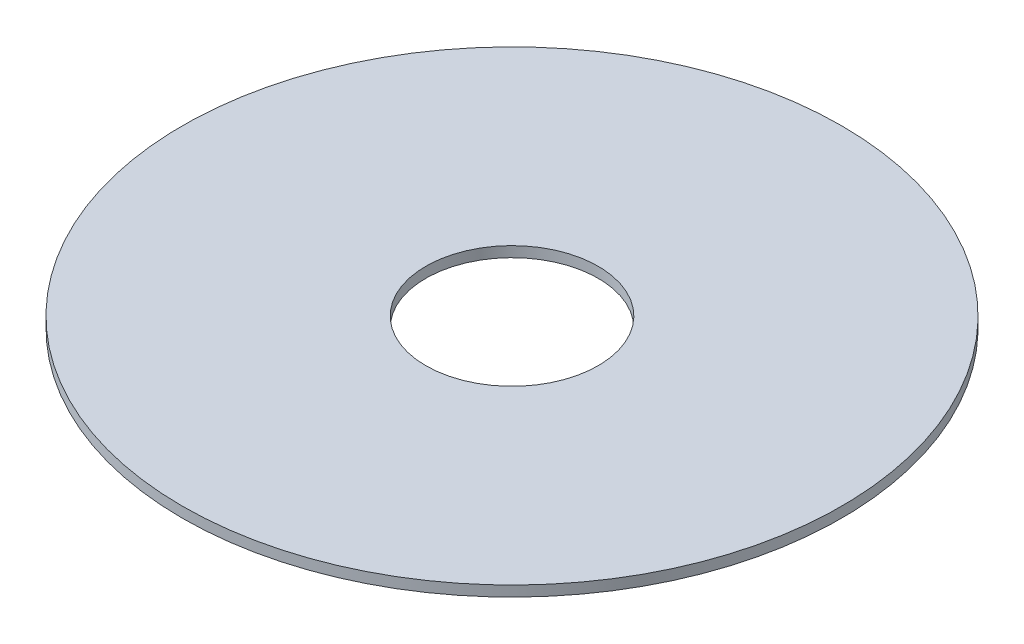
ISO-10303-21;
HEADER;
FILE_DESCRIPTION(('STEP AP214'),'2;1');
FILE_NAME('part.step','',(''),(''),'','','');
FILE_SCHEMA(('AUTOMOTIVE_DESIGN { 1 0 10303 214 1 1 1 1 }'));
ENDSEC;
DATA;
#1=APPLICATION_CONTEXT('core data for automotive mechanical design processes');
#2=APPLICATION_PROTOCOL_DEFINITION('international standard','automotive_design',2000,#1);
#3=PRODUCT_CONTEXT('',#1,'mechanical');
#4=PRODUCT('Part','Part','',(#3));
#5=PRODUCT_RELATED_PRODUCT_CATEGORY('part','',(#4));
#6=PRODUCT_DEFINITION_FORMATION('','',#4);
#7=PRODUCT_DEFINITION_CONTEXT('part definition',#1,'design');
#8=PRODUCT_DEFINITION('design','',#6,#7);
#9=PRODUCT_DEFINITION_SHAPE('','',#8);
#10=(LENGTH_UNIT() NAMED_UNIT(*) SI_UNIT(.MILLI.,.METRE.));
#11=(NAMED_UNIT(*) PLANE_ANGLE_UNIT() SI_UNIT($,.RADIAN.));
#12=(NAMED_UNIT(*) SI_UNIT($,.STERADIAN.) SOLID_ANGLE_UNIT());
#13=UNCERTAINTY_MEASURE_WITH_UNIT(LENGTH_MEASURE(1.E-05),#10,'distance_accuracy_value','');
#14=(GEOMETRIC_REPRESENTATION_CONTEXT(3) GLOBAL_UNCERTAINTY_ASSIGNED_CONTEXT((#13)) GLOBAL_UNIT_ASSIGNED_CONTEXT((#10,
#11,#12)) REPRESENTATION_CONTEXT('',''));
#15=CARTESIAN_POINT('',(0.,0.,0.));
#16=DIRECTION('',(0.,0.,1.));
#17=DIRECTION('',(1.,0.,0.));
#18=AXIS2_PLACEMENT_3D('',#15,#16,#17);
#19=CARTESIAN_POINT('',(0.,1.4875,0.));
#20=DIRECTION('',(0.,1.,0.));
#21=DIRECTION('',(0.,0.,1.));
#22=AXIS2_PLACEMENT_3D('',#19,#20,#21);
#23=PLANE('',#22);
#24=CARTESIAN_POINT('',(0.,1.4875,0.));
#25=DIRECTION('',(0.,1.,0.));
#26=DIRECTION('',(0.,0.,1.));
#27=AXIS2_PLACEMENT_3D('',#24,#25,#26);
#28=CIRCLE('',#27,40.1508);
#29=CARTESIAN_POINT('',(0.,1.4875,40.1508));
#30=VERTEX_POINT('',#29);
#31=EDGE_CURVE('E10',#30,#30,#28,.T.);
#32=ORIENTED_EDGE('',*,*,#31,.T.);
#33=EDGE_LOOP('',(#32));
#34=FACE_BOUND('',#33,.T.);
#35=CARTESIAN_POINT('',(0.,1.4875,0.));
#36=DIRECTION('',(0.,1.,0.));
#37=DIRECTION('',(0.,0.,1.));
#38=AXIS2_PLACEMENT_3D('',#35,#36,#37);
#39=CIRCLE('',#38,10.5);
#40=CARTESIAN_POINT('',(0.,1.4875,10.5));
#41=VERTEX_POINT('',#40);
#42=EDGE_CURVE('E44',#41,#41,#39,.T.);
#43=ORIENTED_EDGE('',*,*,#42,.F.);
#44=EDGE_LOOP('',(#43));
#45=FACE_BOUND('',#44,.T.);
#46=ADVANCED_FACE('F33',(#34,#45),#23,.T.);
#47=CARTESIAN_POINT('',(0.,0.2125,0.));
#48=DIRECTION('',(0.,1.,0.));
#49=DIRECTION('',(0.,0.,1.));
#50=AXIS2_PLACEMENT_3D('',#47,#48,#49);
#51=PLANE('',#50);
#52=CARTESIAN_POINT('',(0.,0.2125,0.));
#53=DIRECTION('',(0.,1.,0.));
#54=DIRECTION('',(0.,0.,1.));
#55=AXIS2_PLACEMENT_3D('',#52,#53,#54);
#56=CIRCLE('',#55,40.1508);
#57=CARTESIAN_POINT('',(0.,0.2125,40.1508));
#58=VERTEX_POINT('',#57);
#59=EDGE_CURVE('E37',#58,#58,#56,.T.);
#60=ORIENTED_EDGE('',*,*,#59,.F.);
#61=EDGE_LOOP('',(#60));
#62=FACE_BOUND('',#61,.T.);
#63=CARTESIAN_POINT('',(0.,0.2125,0.));
#64=DIRECTION('',(0.,1.,0.));
#65=DIRECTION('',(0.,0.,1.));
#66=AXIS2_PLACEMENT_3D('',#63,#64,#65);
#67=CIRCLE('',#66,10.5);
#68=CARTESIAN_POINT('',(0.,0.2125,10.5));
#69=VERTEX_POINT('',#68);
#70=EDGE_CURVE('E46',#69,#69,#67,.T.);
#71=ORIENTED_EDGE('',*,*,#70,.T.);
#72=EDGE_LOOP('',(#71));
#73=FACE_BOUND('',#72,.T.);
#74=ADVANCED_FACE('F56',(#62,#73),#51,.F.);
#75=CARTESIAN_POINT('',(0.,1.4875,0.));
#76=DIRECTION('',(0.,-1.,0.));
#77=DIRECTION('',(0.,0.,-1.));
#78=AXIS2_PLACEMENT_3D('',#75,#76,#77);
#79=CYLINDRICAL_SURFACE('',#78,40.1508);
#80=ORIENTED_EDGE('',*,*,#31,.F.);
#81=EDGE_LOOP('',(#80));
#82=FACE_BOUND('',#81,.T.);
#83=ORIENTED_EDGE('',*,*,#59,.T.);
#84=EDGE_LOOP('',(#83));
#85=FACE_BOUND('',#84,.T.);
#86=ADVANCED_FACE('F35',(#82,#85),#79,.T.);
#87=CARTESIAN_POINT('',(0.,1.4875,0.));
#88=DIRECTION('',(0.,-1.,0.));
#89=DIRECTION('',(0.,0.,-1.));
#90=AXIS2_PLACEMENT_3D('',#87,#88,#89);
#91=CYLINDRICAL_SURFACE('',#90,10.5);
#92=ORIENTED_EDGE('',*,*,#42,.T.);
#93=EDGE_LOOP('',(#92));
#94=FACE_BOUND('',#93,.T.);
#95=ORIENTED_EDGE('',*,*,#70,.F.);
#96=EDGE_LOOP('',(#95));
#97=FACE_BOUND('',#96,.T.);
#98=ADVANCED_FACE('F52',(#94,#97),#91,.F.);
#99=CLOSED_SHELL('',(#46,#74,#86,#98));
#100=MANIFOLD_SOLID_BREP('B2',#99);
#101=ADVANCED_BREP_SHAPE_REPRESENTATION('',(#18,#100),#14);
#102=SHAPE_DEFINITION_REPRESENTATION(#9,#101);
ENDSEC;
END-ISO-10303-21;
